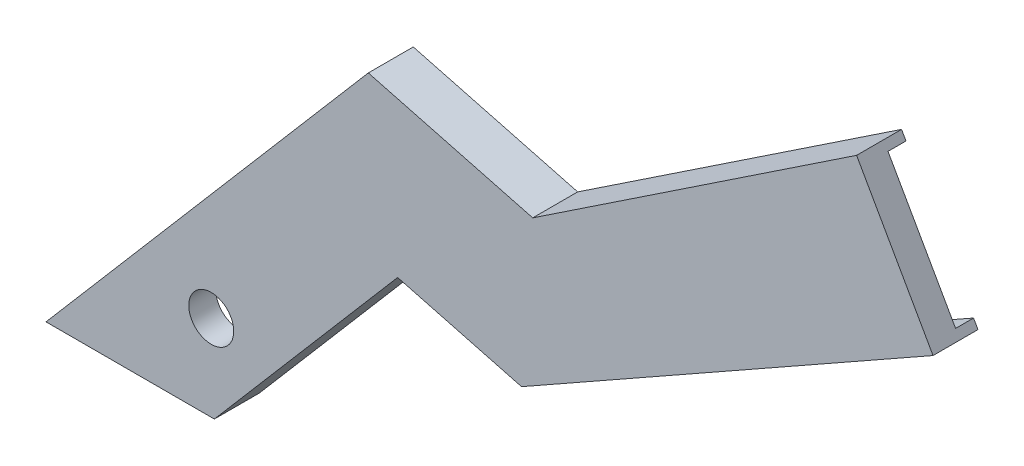
ISO-10303-21;
HEADER;
FILE_DESCRIPTION(('STEP AP214'),'2;1');
FILE_NAME('part.step','',(''),(''),'','','');
FILE_SCHEMA(('AUTOMOTIVE_DESIGN { 1 0 10303 214 1 1 1 1 }'));
ENDSEC;
DATA;
#1=APPLICATION_CONTEXT('core data for automotive mechanical design processes');
#2=APPLICATION_PROTOCOL_DEFINITION('international standard','automotive_design',2000,#1);
#3=PRODUCT_CONTEXT('',#1,'mechanical');
#4=PRODUCT('Part','Part','',(#3));
#5=PRODUCT_RELATED_PRODUCT_CATEGORY('part','',(#4));
#6=PRODUCT_DEFINITION_FORMATION('','',#4);
#7=PRODUCT_DEFINITION_CONTEXT('part definition',#1,'design');
#8=PRODUCT_DEFINITION('design','',#6,#7);
#9=PRODUCT_DEFINITION_SHAPE('','',#8);
#10=(LENGTH_UNIT() NAMED_UNIT(*) SI_UNIT(.MILLI.,.METRE.));
#11=(NAMED_UNIT(*) PLANE_ANGLE_UNIT() SI_UNIT($,.RADIAN.));
#12=(NAMED_UNIT(*) SI_UNIT($,.STERADIAN.) SOLID_ANGLE_UNIT());
#13=UNCERTAINTY_MEASURE_WITH_UNIT(LENGTH_MEASURE(1.E-05),#10,'distance_accuracy_value','');
#14=(GEOMETRIC_REPRESENTATION_CONTEXT(3) GLOBAL_UNCERTAINTY_ASSIGNED_CONTEXT((#13)) GLOBAL_UNIT_ASSIGNED_CONTEXT((#10,
#11,#12)) REPRESENTATION_CONTEXT('',''));
#15=CARTESIAN_POINT('',(0.,0.,0.));
#16=DIRECTION('',(0.,0.,1.));
#17=DIRECTION('',(1.,0.,0.));
#18=AXIS2_PLACEMENT_3D('',#15,#16,#17);
#19=CARTESIAN_POINT('',(0.,0.,-10.));
#20=DIRECTION('',(0.,0.,-1.));
#21=DIRECTION('',(-1.,0.,0.));
#22=AXIS2_PLACEMENT_3D('',#19,#20,#21);
#23=PLANE('',#22);
#24=DIRECTION('',(0.831851620858169,0.55499809087567,0.));
#25=VECTOR('',#24,1.);
#26=CARTESIAN_POINT('',(71.3460566451606,45.1966724435605,-10.));
#27=LINE('',#26,#25);
#28=CARTESIAN_POINT('',(0.361020517094707,-2.16340782072279,-10.));
#29=VERTEX_POINT('',#28);
#30=CARTESIAN_POINT('',(73.0142882611166,46.3096898841454,-10.));
#31=VERTEX_POINT('',#30);
#32=EDGE_CURVE('E395',#29,#31,#27,.T.);
#33=ORIENTED_EDGE('',*,*,#32,.F.);
#34=DIRECTION('',(0.966989850169506,-0.254814892950072,0.));
#35=VECTOR('',#34,1.);
#36=CARTESIAN_POINT('',(-35.8604905500961,7.38144982536127,-10.));
#37=LINE('',#36,#35);
#38=CARTESIAN_POINT('',(-35.8604905500961,7.38144982536127,-10.));
#39=VERTEX_POINT('',#38);
#40=EDGE_CURVE('E392',#39,#29,#37,.T.);
#41=ORIENTED_EDGE('',*,*,#40,.F.);
#42=DIRECTION('',(0.650057725157127,0.759884829407418,0.));
#43=VECTOR('',#42,1.);
#44=CARTESIAN_POINT('',(-103.899575044683,-72.152822460548,-10.));
#45=LINE('',#44,#43);
#46=CARTESIAN_POINT('',(-105.610512544683,-74.152822460548,-10.));
#47=VERTEX_POINT('',#46);
#48=EDGE_CURVE('E236',#47,#39,#45,.T.);
#49=ORIENTED_EDGE('',*,*,#48,.F.);
#50=DIRECTION('',(1.,0.,0.));
#51=VECTOR('',#50,1.);
#52=CARTESIAN_POINT('',(-70.8031079516204,-74.152822460548,-10.));
#53=LINE('',#52,#51);
#54=CARTESIAN_POINT('',(-108.242490342633,-74.152822460548,-10.));
#55=VERTEX_POINT('',#54);
#56=EDGE_CURVE('E144',#55,#47,#53,.T.);
#57=ORIENTED_EDGE('',*,*,#56,.F.);
#58=DIRECTION('',(-0.650057725157127,-0.759884829407418,0.));
#59=VECTOR('',#58,1.);
#60=CARTESIAN_POINT('',(-108.242490342633,-74.152822460548,-10.));
#61=LINE('',#60,#59);
#62=CARTESIAN_POINT('',(-36.5644358592779,9.63522296291781,-10.));
#63=VERTEX_POINT('',#62);
#64=EDGE_CURVE('E209',#63,#55,#61,.T.);
#65=ORIENTED_EDGE('',*,*,#64,.F.);
#66=DIRECTION('',(-0.966989850169506,0.254814892950072,0.));
#67=VECTOR('',#66,1.);
#68=CARTESIAN_POINT('',(-36.5644358592779,9.63522296291781,-10.));
#69=LINE('',#68,#67);
#70=CARTESIAN_POINT('',(0.,0.,-10.));
#71=VERTEX_POINT('',#70);
#72=EDGE_CURVE('E207',#71,#63,#69,.T.);
#73=ORIENTED_EDGE('',*,*,#72,.F.);
#74=DIRECTION('',(-0.831851620858169,-0.554998090875669,0.));
#75=VECTOR('',#74,1.);
#76=CARTESIAN_POINT('',(0.,0.,-10.));
#77=LINE('',#76,#75);
#78=CARTESIAN_POINT('',(72.0271263090322,48.0553461584098,-10.));
#79=VERTEX_POINT('',#78);
#80=EDGE_CURVE('E170',#79,#71,#77,.T.);
#81=ORIENTED_EDGE('',*,*,#80,.F.);
#82=DIRECTION('',(-0.492241162460132,0.870458866334244,0.));
#83=VECTOR('',#82,1.);
#84=CARTESIAN_POINT('',(72.0271263090322,48.0553461584098,-10.));
#85=LINE('',#84,#83);
#86=EDGE_CURVE('E60',#31,#79,#85,.T.);
#87=ORIENTED_EDGE('',*,*,#86,.F.);
#88=EDGE_LOOP('',(#33,#41,#49,#57,#65,#73,#81,#87));
#89=FACE_BOUND('',#88,.T.);
#90=ADVANCED_FACE('F35',(#89),#23,.T.);
#91=CARTESIAN_POINT('',(0.,0.,-10.));
#92=DIRECTION('',(-0.554998090875669,0.831851620858169,0.));
#93=DIRECTION('',(-0.831851620858169,-0.554998090875669,0.));
#94=AXIS2_PLACEMENT_3D('',#91,#92,#93);
#95=PLANE('',#94);
#96=DIRECTION('',(-0.831851620858169,-0.554998090875669,0.));
#97=VECTOR('',#96,1.);
#98=CARTESIAN_POINT('',(0.,0.,0.));
#99=LINE('',#98,#97);
#100=CARTESIAN_POINT('',(72.0271263090322,48.0553461584098,0.));
#101=VERTEX_POINT('',#100);
#102=CARTESIAN_POINT('',(0.,0.,0.));
#103=VERTEX_POINT('',#102);
#104=EDGE_CURVE('E149',#101,#103,#99,.T.);
#105=ORIENTED_EDGE('',*,*,#104,.F.);
#106=DIRECTION('',(0.,0.,1.));
#107=VECTOR('',#106,1.);
#108=CARTESIAN_POINT('',(72.0271263090322,48.0553461584098,-10.));
#109=LINE('',#108,#107);
#110=EDGE_CURVE('E11',#79,#101,#109,.T.);
#111=ORIENTED_EDGE('',*,*,#110,.F.);
#112=ORIENTED_EDGE('',*,*,#80,.T.);
#113=DIRECTION('',(0.,0.,1.));
#114=VECTOR('',#113,1.);
#115=CARTESIAN_POINT('',(0.,0.,-10.));
#116=LINE('',#115,#114);
#117=EDGE_CURVE('E98',#71,#103,#116,.T.);
#118=ORIENTED_EDGE('',*,*,#117,.T.);
#119=EDGE_LOOP('',(#105,#111,#112,#118));
#120=FACE_BOUND('',#119,.T.);
#121=ADVANCED_FACE('F37',(#120),#95,.T.);
#122=CARTESIAN_POINT('',(72.0271263090322,48.0553461584098,-10.));
#123=DIRECTION('',(0.870458866334244,0.492241162460132,0.));
#124=DIRECTION('',(-0.492241162460132,0.870458866334244,0.));
#125=AXIS2_PLACEMENT_3D('',#122,#123,#124);
#126=PLANE('',#125);
#127=DIRECTION('',(0.,0.,-1.));
#128=VECTOR('',#127,1.);
#129=CARTESIAN_POINT('',(73.0142882611166,46.3096898841454,-6.));
#130=LINE('',#129,#128);
#131=CARTESIAN_POINT('',(73.0142882611166,46.3096898841454,-6.));
#132=VERTEX_POINT('',#131);
#133=EDGE_CURVE('E398',#132,#31,#130,.T.);
#134=ORIENTED_EDGE('',*,*,#133,.T.);
#135=ORIENTED_EDGE('',*,*,#86,.T.);
#136=ORIENTED_EDGE('',*,*,#110,.T.);
#137=DIRECTION('',(-0.492241162460132,0.870458866334244,0.));
#138=VECTOR('',#137,1.);
#139=CARTESIAN_POINT('',(72.0271263090322,48.0553461584098,0.));
#140=LINE('',#139,#138);
#141=CARTESIAN_POINT('',(89.0276420775297,17.9923388126105,0.));
#142=VERTEX_POINT('',#141);
#143=EDGE_CURVE('E168',#142,#101,#140,.T.);
#144=ORIENTED_EDGE('',*,*,#143,.F.);
#145=DIRECTION('',(0.,0.,1.));
#146=VECTOR('',#145,1.);
#147=CARTESIAN_POINT('',(89.0276420775297,17.9923388126105,-10.));
#148=LINE('',#147,#146);
#149=CARTESIAN_POINT('',(89.0276420775297,17.9923388126105,-10.));
#150=VERTEX_POINT('',#149);
#151=EDGE_CURVE('E44',#150,#142,#148,.T.);
#152=ORIENTED_EDGE('',*,*,#151,.F.);
#153=CARTESIAN_POINT('',(88.0431597526095,19.733256545279,-10.));
#154=VERTEX_POINT('',#153);
#155=EDGE_CURVE('E139',#150,#154,#85,.T.);
#156=ORIENTED_EDGE('',*,*,#155,.T.);
#157=DIRECTION('',(0.,0.,-1.));
#158=VECTOR('',#157,1.);
#159=CARTESIAN_POINT('',(88.0431597526094,19.733256545279,-6.));
#160=LINE('',#159,#158);
#161=CARTESIAN_POINT('',(88.0431597526094,19.733256545279,-6.));
#162=VERTEX_POINT('',#161);
#163=EDGE_CURVE('E52',#162,#154,#160,.T.);
#164=ORIENTED_EDGE('',*,*,#163,.F.);
#165=DIRECTION('',(0.492241162460132,-0.870458866334244,0.));
#166=VECTOR('',#165,1.);
#167=CARTESIAN_POINT('',(88.0431597526094,19.733256545279,-6.));
#168=LINE('',#167,#166);
#169=EDGE_CURVE('E190',#132,#162,#168,.T.);
#170=ORIENTED_EDGE('',*,*,#169,.F.);
#171=EDGE_LOOP('',(#134,#135,#136,#144,#152,#156,#164,#170));
#172=FACE_BOUND('',#171,.T.);
#173=ADVANCED_FACE('F186',(#172),#126,.T.);
#174=CARTESIAN_POINT('',(89.0276420775297,17.9923388126105,-10.));
#175=DIRECTION('',(0.492241162460132,-0.870458866334245,0.));
#176=DIRECTION('',(0.870458866334244,0.492241162460132,0.));
#177=AXIS2_PLACEMENT_3D('',#174,#175,#176);
#178=PLANE('',#177);
#179=DIRECTION('',(0.870458866334245,0.492241162460132,0.));
#180=VECTOR('',#179,1.);
#181=CARTESIAN_POINT('',(89.0276420775297,17.9923388126105,0.));
#182=LINE('',#181,#180);
#183=CARTESIAN_POINT('',(-2.4874686618368,-33.7591065862073,0.));
#184=VERTEX_POINT('',#183);
#185=EDGE_CURVE('E124',#184,#142,#182,.T.);
#186=ORIENTED_EDGE('',*,*,#185,.F.);
#187=DIRECTION('',(0.,0.,1.));
#188=VECTOR('',#187,1.);
#189=CARTESIAN_POINT('',(-2.4874686618368,-33.7591065862073,-10.));
#190=LINE('',#189,#188);
#191=CARTESIAN_POINT('',(-2.4874686618368,-33.7591065862073,-10.));
#192=VERTEX_POINT('',#191);
#193=EDGE_CURVE('E118',#192,#184,#190,.T.);
#194=ORIENTED_EDGE('',*,*,#193,.F.);
#195=DIRECTION('',(0.870458866334245,0.492241162460132,0.));
#196=VECTOR('',#195,1.);
#197=CARTESIAN_POINT('',(89.0276420775297,17.9923388126105,-10.));
#198=LINE('',#197,#196);
#199=EDGE_CURVE('E121',#192,#150,#198,.T.);
#200=ORIENTED_EDGE('',*,*,#199,.T.);
#201=ORIENTED_EDGE('',*,*,#151,.T.);
#202=EDGE_LOOP('',(#186,#194,#200,#201));
#203=FACE_BOUND('',#202,.T.);
#204=ADVANCED_FACE('F120',(#203),#178,.T.);
#205=CARTESIAN_POINT('',(-2.4874686618368,-33.7591065862073,-10.));
#206=DIRECTION('',(-0.254814892950072,-0.966989850169506,0.));
#207=DIRECTION('',(0.966989850169506,-0.254814892950072,0.));
#208=AXIS2_PLACEMENT_3D('',#205,#206,#207);
#209=PLANE('',#208);
#210=DIRECTION('',(0.966989850169506,-0.254814892950072,0.));
#211=VECTOR('',#210,1.);
#212=CARTESIAN_POINT('',(-2.4874686618368,-33.7591065862073,0.));
#213=LINE('',#212,#211);
#214=CARTESIAN_POINT('',(-30.0370997650738,-26.4994064981922,0.));
#215=VERTEX_POINT('',#214);
#216=EDGE_CURVE('E165',#215,#184,#213,.T.);
#217=ORIENTED_EDGE('',*,*,#216,.F.);
#218=DIRECTION('',(0.,0.,1.));
#219=VECTOR('',#218,1.);
#220=CARTESIAN_POINT('',(-30.0370997650738,-26.4994064981922,-10.));
#221=LINE('',#220,#219);
#222=CARTESIAN_POINT('',(-30.0370997650738,-26.4994064981922,-10.));
#223=VERTEX_POINT('',#222);
#224=EDGE_CURVE('E129',#223,#215,#221,.T.);
#225=ORIENTED_EDGE('',*,*,#224,.F.);
#226=DIRECTION('',(0.966989850169506,-0.254814892950072,0.));
#227=VECTOR('',#226,1.);
#228=CARTESIAN_POINT('',(-2.4874686618368,-33.7591065862073,-10.));
#229=LINE('',#228,#227);
#230=EDGE_CURVE('E136',#223,#192,#229,.T.);
#231=ORIENTED_EDGE('',*,*,#230,.T.);
#232=ORIENTED_EDGE('',*,*,#193,.T.);
#233=EDGE_LOOP('',(#217,#225,#231,#232));
#234=FACE_BOUND('',#233,.T.);
#235=ADVANCED_FACE('F141',(#234),#209,.T.);
#236=CARTESIAN_POINT('',(-30.0370997650738,-26.4994064981922,-10.));
#237=DIRECTION('',(0.759884829407418,-0.650057725157127,0.));
#238=DIRECTION('',(0.650057725157127,0.759884829407418,0.));
#239=AXIS2_PLACEMENT_3D('',#236,#237,#238);
#240=PLANE('',#239);
#241=DIRECTION('',(0.650057725157127,0.759884829407418,0.));
#242=VECTOR('',#241,1.);
#243=CARTESIAN_POINT('',(-30.0370997650738,-26.4994064981922,0.));
#244=LINE('',#243,#242);
#245=CARTESIAN_POINT('',(-70.8031079516204,-74.152822460548,0.));
#246=VERTEX_POINT('',#245);
#247=EDGE_CURVE('E162',#246,#215,#244,.T.);
#248=ORIENTED_EDGE('',*,*,#247,.F.);
#249=DIRECTION('',(0.,0.,1.));
#250=VECTOR('',#249,1.);
#251=CARTESIAN_POINT('',(-70.8031079516204,-74.152822460548,-10.));
#252=LINE('',#251,#250);
#253=CARTESIAN_POINT('',(-70.8031079516204,-74.152822460548,-10.));
#254=VERTEX_POINT('',#253);
#255=EDGE_CURVE('E174',#254,#246,#252,.T.);
#256=ORIENTED_EDGE('',*,*,#255,.F.);
#257=DIRECTION('',(0.650057725157127,0.759884829407418,0.));
#258=VECTOR('',#257,1.);
#259=CARTESIAN_POINT('',(-30.0370997650738,-26.4994064981922,-10.));
#260=LINE('',#259,#258);
#261=EDGE_CURVE('E142',#254,#223,#260,.T.);
#262=ORIENTED_EDGE('',*,*,#261,.T.);
#263=ORIENTED_EDGE('',*,*,#224,.T.);
#264=EDGE_LOOP('',(#248,#256,#262,#263));
#265=FACE_BOUND('',#264,.T.);
#266=ADVANCED_FACE('F228',(#265),#240,.T.);
#267=CARTESIAN_POINT('',(-70.8031079516204,-74.152822460548,-10.));
#268=DIRECTION('',(0.,-1.,0.));
#269=DIRECTION('',(0.,0.,-1.));
#270=AXIS2_PLACEMENT_3D('',#267,#268,#269);
#271=PLANE('',#270);
#272=DIRECTION('',(0.,0.,-1.));
#273=VECTOR('',#272,1.);
#274=CARTESIAN_POINT('',(-105.610512544683,-74.152822460548,-6.));
#275=LINE('',#274,#273);
#276=CARTESIAN_POINT('',(-105.610512544683,-74.152822460548,-6.));
#277=VERTEX_POINT('',#276);
#278=EDGE_CURVE('E406',#277,#47,#275,.T.);
#279=ORIENTED_EDGE('',*,*,#278,.F.);
#280=DIRECTION('',(-1.,0.,0.));
#281=VECTOR('',#280,1.);
#282=CARTESIAN_POINT('',(-73.4350857495712,-74.152822460548,-6.));
#283=LINE('',#282,#281);
#284=CARTESIAN_POINT('',(-73.4350857495712,-74.152822460548,-6.));
#285=VERTEX_POINT('',#284);
#286=EDGE_CURVE('E444',#285,#277,#283,.T.);
#287=ORIENTED_EDGE('',*,*,#286,.F.);
#288=DIRECTION('',(0.,0.,-1.));
#289=VECTOR('',#288,1.);
#290=CARTESIAN_POINT('',(-73.4350857495712,-74.152822460548,-6.));
#291=LINE('',#290,#289);
#292=CARTESIAN_POINT('',(-73.4350857495712,-74.152822460548,-10.));
#293=VERTEX_POINT('',#292);
#294=EDGE_CURVE('E226',#285,#293,#291,.T.);
#295=ORIENTED_EDGE('',*,*,#294,.T.);
#296=EDGE_CURVE('E211',#293,#254,#53,.T.);
#297=ORIENTED_EDGE('',*,*,#296,.T.);
#298=ORIENTED_EDGE('',*,*,#255,.T.);
#299=DIRECTION('',(1.,0.,0.));
#300=VECTOR('',#299,1.);
#301=CARTESIAN_POINT('',(-70.8031079516204,-74.152822460548,0.));
#302=LINE('',#301,#300);
#303=CARTESIAN_POINT('',(-108.242490342633,-74.152822460548,0.));
#304=VERTEX_POINT('',#303);
#305=EDGE_CURVE('E159',#304,#246,#302,.T.);
#306=ORIENTED_EDGE('',*,*,#305,.F.);
#307=DIRECTION('',(0.,0.,1.));
#308=VECTOR('',#307,1.);
#309=CARTESIAN_POINT('',(-108.242490342633,-74.152822460548,-10.));
#310=LINE('',#309,#308);
#311=EDGE_CURVE('E176',#55,#304,#310,.T.);
#312=ORIENTED_EDGE('',*,*,#311,.F.);
#313=ORIENTED_EDGE('',*,*,#56,.T.);
#314=EDGE_LOOP('',(#279,#287,#295,#297,#298,#306,#312,#313));
#315=FACE_BOUND('',#314,.T.);
#316=ADVANCED_FACE('F220',(#315),#271,.T.);
#317=CARTESIAN_POINT('',(-108.242490342633,-74.152822460548,-10.));
#318=DIRECTION('',(-0.759884829407418,0.650057725157127,0.));
#319=DIRECTION('',(-0.650057725157127,-0.759884829407418,0.));
#320=AXIS2_PLACEMENT_3D('',#317,#318,#319);
#321=PLANE('',#320);
#322=DIRECTION('',(-0.650057725157127,-0.759884829407418,0.));
#323=VECTOR('',#322,1.);
#324=CARTESIAN_POINT('',(-108.242490342633,-74.152822460548,0.));
#325=LINE('',#324,#323);
#326=CARTESIAN_POINT('',(-36.5644358592779,9.63522296291781,0.));
#327=VERTEX_POINT('',#326);
#328=EDGE_CURVE('E156',#327,#304,#325,.T.);
#329=ORIENTED_EDGE('',*,*,#328,.F.);
#330=DIRECTION('',(0.,0.,1.));
#331=VECTOR('',#330,1.);
#332=CARTESIAN_POINT('',(-36.5644358592779,9.63522296291781,-10.));
#333=LINE('',#332,#331);
#334=EDGE_CURVE('E178',#63,#327,#333,.T.);
#335=ORIENTED_EDGE('',*,*,#334,.F.);
#336=ORIENTED_EDGE('',*,*,#64,.T.);
#337=ORIENTED_EDGE('',*,*,#311,.T.);
#338=EDGE_LOOP('',(#329,#335,#336,#337));
#339=FACE_BOUND('',#338,.T.);
#340=ADVANCED_FACE('F237',(#339),#321,.T.);
#341=CARTESIAN_POINT('',(-36.5644358592779,9.63522296291781,-10.));
#342=DIRECTION('',(0.254814892950072,0.966989850169506,0.));
#343=DIRECTION('',(-0.966989850169506,0.254814892950072,0.));
#344=AXIS2_PLACEMENT_3D('',#341,#342,#343);
#345=PLANE('',#344);
#346=DIRECTION('',(-0.966989850169506,0.254814892950072,0.));
#347=VECTOR('',#346,1.);
#348=CARTESIAN_POINT('',(-36.5644358592779,9.63522296291781,0.));
#349=LINE('',#348,#347);
#350=EDGE_CURVE('E152',#103,#327,#349,.T.);
#351=ORIENTED_EDGE('',*,*,#350,.F.);
#352=ORIENTED_EDGE('',*,*,#117,.F.);
#353=ORIENTED_EDGE('',*,*,#72,.T.);
#354=ORIENTED_EDGE('',*,*,#334,.T.);
#355=EDGE_LOOP('',(#351,#352,#353,#354));
#356=FACE_BOUND('',#355,.T.);
#357=ADVANCED_FACE('F182',(#356),#345,.T.);
#358=DIRECTION('',(-0.650057725157126,-0.759884829407419,0.));
#359=VECTOR('',#358,1.);
#360=CARTESIAN_POINT('',(-71.7241482495712,-72.152822460548,-10.));
#361=LINE('',#360,#359);
#362=CARTESIAN_POINT('',(-30.7410450742555,-24.2456333606356,-10.));
#363=VERTEX_POINT('',#362);
#364=EDGE_CURVE('E386',#363,#293,#361,.T.);
#365=ORIENTED_EDGE('',*,*,#364,.F.);
#366=DIRECTION('',(-0.966989850169506,0.254814892950072,0.));
#367=VECTOR('',#366,1.);
#368=CARTESIAN_POINT('',(-2.76414177146878,-31.6179254471808,-10.));
#369=LINE('',#368,#367);
#370=CARTESIAN_POINT('',(-2.76414177146878,-31.6179254471808,-10.));
#371=VERTEX_POINT('',#370);
#372=EDGE_CURVE('E382',#371,#363,#369,.T.);
#373=ORIENTED_EDGE('',*,*,#372,.F.);
#374=DIRECTION('',(-0.870458866334244,-0.492241162460132,0.));
#375=VECTOR('',#374,1.);
#376=CARTESIAN_POINT('',(86.3022420199409,18.7487742203587,-10.));
#377=LINE('',#376,#375);
#378=EDGE_CURVE('E377',#154,#371,#377,.T.);
#379=ORIENTED_EDGE('',*,*,#378,.F.);
#380=ORIENTED_EDGE('',*,*,#155,.F.);
#381=ORIENTED_EDGE('',*,*,#199,.F.);
#382=ORIENTED_EDGE('',*,*,#230,.F.);
#383=ORIENTED_EDGE('',*,*,#261,.F.);
#384=ORIENTED_EDGE('',*,*,#296,.F.);
#385=EDGE_LOOP('',(#365,#373,#379,#380,#381,#382,#383,#384));
#386=FACE_BOUND('',#385,.T.);
#387=ADVANCED_FACE('F134',(#386),#23,.T.);
#388=CARTESIAN_POINT('',(0.,0.,0.));
#389=DIRECTION('',(0.,0.,-1.));
#390=DIRECTION('',(-1.,0.,0.));
#391=AXIS2_PLACEMENT_3D('',#388,#389,#390);
#392=PLANE('',#391);
#393=CARTESIAN_POINT('',(-71.490774549545,-55.1047281037053,0.));
#394=DIRECTION('',(0.,0.,1.));
#395=DIRECTION('',(1.,0.,0.));
#396=AXIS2_PLACEMENT_3D('',#393,#394,#395);
#397=CIRCLE('',#396,5.00000000000001);
#398=CARTESIAN_POINT('',(-66.490774549545,-55.1047281037053,0.));
#399=VERTEX_POINT('',#398);
#400=EDGE_CURVE('E153',#399,#399,#397,.T.);
#401=ORIENTED_EDGE('',*,*,#400,.F.);
#402=EDGE_LOOP('',(#401));
#403=FACE_BOUND('',#402,.T.);
#404=ORIENTED_EDGE('',*,*,#104,.T.);
#405=ORIENTED_EDGE('',*,*,#350,.T.);
#406=ORIENTED_EDGE('',*,*,#328,.T.);
#407=ORIENTED_EDGE('',*,*,#305,.T.);
#408=ORIENTED_EDGE('',*,*,#247,.T.);
#409=ORIENTED_EDGE('',*,*,#216,.T.);
#410=ORIENTED_EDGE('',*,*,#185,.T.);
#411=ORIENTED_EDGE('',*,*,#143,.T.);
#412=EDGE_LOOP('',(#404,#405,#406,#407,#408,#409,#410,#411));
#413=FACE_BOUND('',#412,.T.);
#414=ADVANCED_FACE('F185',(#403,#413),#392,.F.);
#415=CARTESIAN_POINT('',(-71.490774549545,-55.1047281037053,-10.));
#416=DIRECTION('',(0.,0.,1.));
#417=DIRECTION('',(1.,0.,0.));
#418=AXIS2_PLACEMENT_3D('',#415,#416,#417);
#419=CYLINDRICAL_SURFACE('',#418,5.00000000000001);
#420=CARTESIAN_POINT('',(-71.490774549545,-55.1047281037053,-6.));
#421=DIRECTION('',(0.,0.,1.));
#422=DIRECTION('',(1.,0.,0.));
#423=AXIS2_PLACEMENT_3D('',#420,#421,#422);
#424=CIRCLE('',#423,5.00000000000001);
#425=CARTESIAN_POINT('',(-66.490774549545,-55.1047281037053,-6.));
#426=VERTEX_POINT('',#425);
#427=EDGE_CURVE('E39',#426,#426,#424,.F.);
#428=ORIENTED_EDGE('',*,*,#427,.T.);
#429=EDGE_LOOP('',(#428));
#430=FACE_BOUND('',#429,.T.);
#431=ORIENTED_EDGE('',*,*,#400,.T.);
#432=EDGE_LOOP('',(#431));
#433=FACE_BOUND('',#432,.T.);
#434=ADVANCED_FACE('F256',(#430,#433),#419,.F.);
#435=CARTESIAN_POINT('',(0.,0.,-6.));
#436=DIRECTION('',(0.,0.,1.));
#437=DIRECTION('',(1.,0.,0.));
#438=AXIS2_PLACEMENT_3D('',#435,#436,#437);
#439=PLANE('',#438);
#440=ORIENTED_EDGE('',*,*,#169,.T.);
#441=DIRECTION('',(-0.870458866334244,-0.492241162460132,0.));
#442=VECTOR('',#441,1.);
#443=CARTESIAN_POINT('',(86.3022420199409,18.7487742203587,-6.));
#444=LINE('',#443,#442);
#445=CARTESIAN_POINT('',(-2.76414177146878,-31.6179254471808,-6.));
#446=VERTEX_POINT('',#445);
#447=EDGE_CURVE('E451',#162,#446,#444,.T.);
#448=ORIENTED_EDGE('',*,*,#447,.T.);
#449=DIRECTION('',(-0.966989850169506,0.254814892950072,0.));
#450=VECTOR('',#449,1.);
#451=CARTESIAN_POINT('',(-2.76414177146878,-31.6179254471808,-6.));
#452=LINE('',#451,#450);
#453=CARTESIAN_POINT('',(-30.7410450742555,-24.2456333606356,-6.));
#454=VERTEX_POINT('',#453);
#455=EDGE_CURVE('E416',#446,#454,#452,.T.);
#456=ORIENTED_EDGE('',*,*,#455,.T.);
#457=DIRECTION('',(-0.650057725157127,-0.759884829407418,0.));
#458=VECTOR('',#457,1.);
#459=CARTESIAN_POINT('',(-30.7410450742555,-24.2456333606356,-6.));
#460=LINE('',#459,#458);
#461=EDGE_CURVE('E413',#454,#285,#460,.T.);
#462=ORIENTED_EDGE('',*,*,#461,.T.);
#463=ORIENTED_EDGE('',*,*,#286,.T.);
#464=DIRECTION('',(0.650057725157126,0.759884829407419,0.));
#465=VECTOR('',#464,1.);
#466=CARTESIAN_POINT('',(-103.899575044683,-72.152822460548,-6.));
#467=LINE('',#466,#465);
#468=CARTESIAN_POINT('',(-35.8604905500961,7.38144982536127,-6.));
#469=VERTEX_POINT('',#468);
#470=EDGE_CURVE('E442',#277,#469,#467,.T.);
#471=ORIENTED_EDGE('',*,*,#470,.T.);
#472=DIRECTION('',(0.966989850169506,-0.254814892950072,0.));
#473=VECTOR('',#472,1.);
#474=CARTESIAN_POINT('',(-35.8604905500961,7.38144982536127,-6.));
#475=LINE('',#474,#473);
#476=CARTESIAN_POINT('',(0.361020517094707,-2.16340782072279,-6.));
#477=VERTEX_POINT('',#476);
#478=EDGE_CURVE('E200',#469,#477,#475,.T.);
#479=ORIENTED_EDGE('',*,*,#478,.T.);
#480=DIRECTION('',(0.831851620858169,0.554998090875669,0.));
#481=VECTOR('',#480,1.);
#482=CARTESIAN_POINT('',(0.361020517094707,-2.16340782072279,-6.));
#483=LINE('',#482,#481);
#484=EDGE_CURVE('E194',#477,#132,#483,.T.);
#485=ORIENTED_EDGE('',*,*,#484,.T.);
#486=EDGE_LOOP('',(#440,#448,#456,#462,#463,#471,#479,#485));
#487=FACE_BOUND('',#486,.T.);
#488=ORIENTED_EDGE('',*,*,#427,.F.);
#489=EDGE_LOOP('',(#488));
#490=FACE_BOUND('',#489,.T.);
#491=ADVANCED_FACE('F261',(#487,#490),#439,.F.);
#492=CARTESIAN_POINT('',(71.3460566451606,45.1966724435605,-6.));
#493=DIRECTION('',(-0.55499809087567,0.831851620858169,0.));
#494=DIRECTION('',(-0.831851620858169,-0.55499809087567,0.));
#495=AXIS2_PLACEMENT_3D('',#492,#493,#494);
#496=PLANE('',#495);
#497=ORIENTED_EDGE('',*,*,#32,.T.);
#498=ORIENTED_EDGE('',*,*,#133,.F.);
#499=ORIENTED_EDGE('',*,*,#484,.F.);
#500=DIRECTION('',(0.,0.,-1.));
#501=VECTOR('',#500,1.);
#502=CARTESIAN_POINT('',(0.361020517094707,-2.16340782072279,-6.));
#503=LINE('',#502,#501);
#504=EDGE_CURVE('E400',#477,#29,#503,.T.);
#505=ORIENTED_EDGE('',*,*,#504,.T.);
#506=EDGE_LOOP('',(#497,#498,#499,#505));
#507=FACE_BOUND('',#506,.T.);
#508=ADVANCED_FACE('F306',(#507),#496,.F.);
#509=CARTESIAN_POINT('',(-35.8604905500961,7.38144982536127,-6.));
#510=DIRECTION('',(0.254814892950072,0.966989850169506,0.));
#511=DIRECTION('',(-0.966989850169506,0.254814892950072,0.));
#512=AXIS2_PLACEMENT_3D('',#509,#510,#511);
#513=PLANE('',#512);
#514=ORIENTED_EDGE('',*,*,#40,.T.);
#515=ORIENTED_EDGE('',*,*,#504,.F.);
#516=ORIENTED_EDGE('',*,*,#478,.F.);
#517=DIRECTION('',(0.,0.,-1.));
#518=VECTOR('',#517,1.);
#519=CARTESIAN_POINT('',(-35.8604905500961,7.38144982536127,-6.));
#520=LINE('',#519,#518);
#521=EDGE_CURVE('E403',#469,#39,#520,.T.);
#522=ORIENTED_EDGE('',*,*,#521,.T.);
#523=EDGE_LOOP('',(#514,#515,#516,#522));
#524=FACE_BOUND('',#523,.T.);
#525=ADVANCED_FACE('F317',(#524),#513,.F.);
#526=CARTESIAN_POINT('',(-103.899575044683,-72.152822460548,-6.));
#527=DIRECTION('',(-0.759884829407418,0.650057725157127,0.));
#528=DIRECTION('',(-0.650057725157127,-0.759884829407418,0.));
#529=AXIS2_PLACEMENT_3D('',#526,#527,#528);
#530=PLANE('',#529);
#531=ORIENTED_EDGE('',*,*,#48,.T.);
#532=ORIENTED_EDGE('',*,*,#521,.F.);
#533=ORIENTED_EDGE('',*,*,#470,.F.);
#534=ORIENTED_EDGE('',*,*,#278,.T.);
#535=EDGE_LOOP('',(#531,#532,#533,#534));
#536=FACE_BOUND('',#535,.T.);
#537=ADVANCED_FACE('F327',(#536),#530,.F.);
#538=CARTESIAN_POINT('',(-71.7241482495712,-72.152822460548,-6.));
#539=DIRECTION('',(0.759884829407419,-0.650057725157126,0.));
#540=DIRECTION('',(0.650057725157126,0.759884829407419,0.));
#541=AXIS2_PLACEMENT_3D('',#538,#539,#540);
#542=PLANE('',#541);
#543=ORIENTED_EDGE('',*,*,#364,.T.);
#544=ORIENTED_EDGE('',*,*,#294,.F.);
#545=ORIENTED_EDGE('',*,*,#461,.F.);
#546=DIRECTION('',(0.,0.,-1.));
#547=VECTOR('',#546,1.);
#548=CARTESIAN_POINT('',(-30.7410450742555,-24.2456333606356,-6.));
#549=LINE('',#548,#547);
#550=EDGE_CURVE('E197',#454,#363,#549,.T.);
#551=ORIENTED_EDGE('',*,*,#550,.T.);
#552=EDGE_LOOP('',(#543,#544,#545,#551));
#553=FACE_BOUND('',#552,.T.);
#554=ADVANCED_FACE('F338',(#553),#542,.F.);
#555=CARTESIAN_POINT('',(-2.76414177146878,-31.6179254471808,-6.));
#556=DIRECTION('',(-0.254814892950072,-0.966989850169506,0.));
#557=DIRECTION('',(0.966989850169506,-0.254814892950072,0.));
#558=AXIS2_PLACEMENT_3D('',#555,#556,#557);
#559=PLANE('',#558);
#560=ORIENTED_EDGE('',*,*,#372,.T.);
#561=ORIENTED_EDGE('',*,*,#550,.F.);
#562=ORIENTED_EDGE('',*,*,#455,.F.);
#563=DIRECTION('',(0.,0.,-1.));
#564=VECTOR('',#563,1.);
#565=CARTESIAN_POINT('',(-2.76414177146878,-31.6179254471808,-6.));
#566=LINE('',#565,#564);
#567=EDGE_CURVE('E193',#446,#371,#566,.T.);
#568=ORIENTED_EDGE('',*,*,#567,.T.);
#569=EDGE_LOOP('',(#560,#561,#562,#568));
#570=FACE_BOUND('',#569,.T.);
#571=ADVANCED_FACE('F349',(#570),#559,.F.);
#572=CARTESIAN_POINT('',(86.3022420199409,18.7487742203587,-6.));
#573=DIRECTION('',(0.492241162460132,-0.870458866334244,0.));
#574=DIRECTION('',(0.870458866334245,0.492241162460132,0.));
#575=AXIS2_PLACEMENT_3D('',#572,#573,#574);
#576=PLANE('',#575);
#577=ORIENTED_EDGE('',*,*,#378,.T.);
#578=ORIENTED_EDGE('',*,*,#567,.F.);
#579=ORIENTED_EDGE('',*,*,#447,.F.);
#580=ORIENTED_EDGE('',*,*,#163,.T.);
#581=EDGE_LOOP('',(#577,#578,#579,#580));
#582=FACE_BOUND('',#581,.T.);
#583=ADVANCED_FACE('F359',(#582),#576,.F.);
#584=CLOSED_SHELL('',(#90,#121,#173,#204,#235,#266,#316,#340,#357,#387,#414,#434,#491,#508,#525,
#537,#554,#571,#583));
#585=MANIFOLD_SOLID_BREP('B2',#584);
#586=ADVANCED_BREP_SHAPE_REPRESENTATION('',(#18,#585),#14);
#587=SHAPE_DEFINITION_REPRESENTATION(#9,#586);
ENDSEC;
END-ISO-10303-21;
